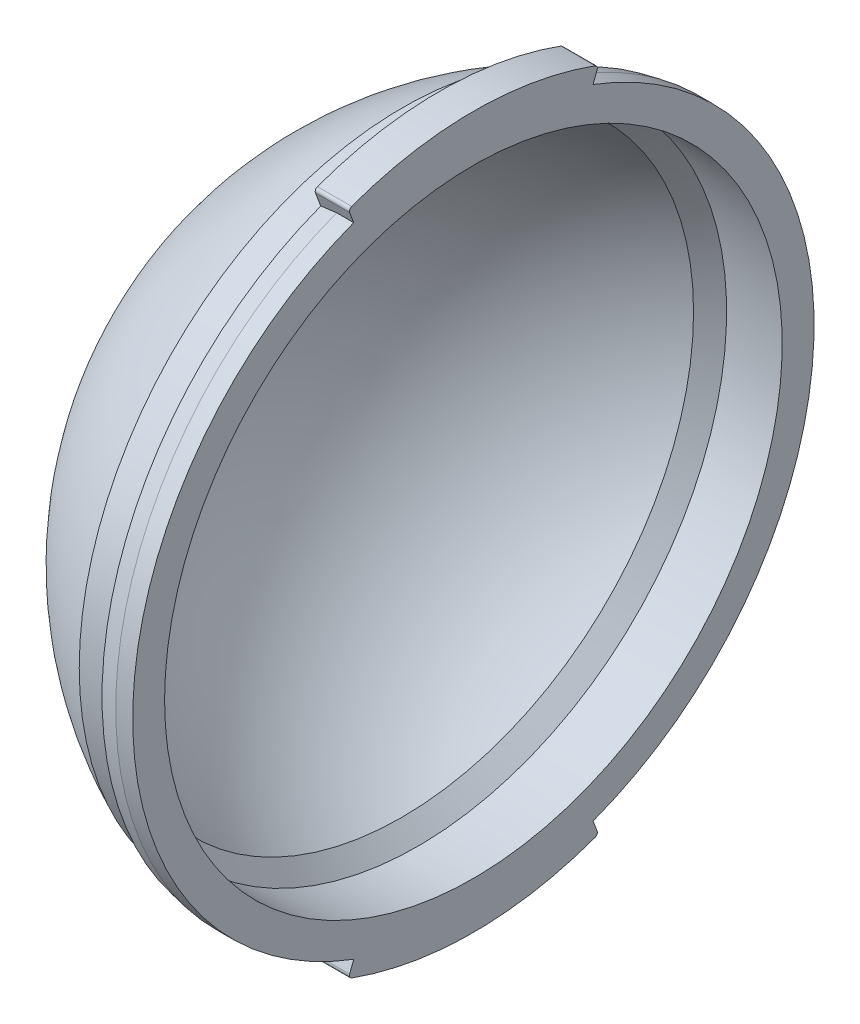
ISO-10303-21;
HEADER;
FILE_DESCRIPTION(('STEP AP214'),'2;1');
FILE_NAME('part.step','',(''),(''),'','','');
FILE_SCHEMA(('AUTOMOTIVE_DESIGN { 1 0 10303 214 1 1 1 1 }'));
ENDSEC;
DATA;
#1=APPLICATION_CONTEXT('core data for automotive mechanical design processes');
#2=APPLICATION_PROTOCOL_DEFINITION('international standard','automotive_design',2000,#1);
#3=PRODUCT_CONTEXT('',#1,'mechanical');
#4=PRODUCT('Part','Part','',(#3));
#5=PRODUCT_RELATED_PRODUCT_CATEGORY('part','',(#4));
#6=PRODUCT_DEFINITION_FORMATION('','',#4);
#7=PRODUCT_DEFINITION_CONTEXT('part definition',#1,'design');
#8=PRODUCT_DEFINITION('design','',#6,#7);
#9=PRODUCT_DEFINITION_SHAPE('','',#8);
#10=(LENGTH_UNIT() NAMED_UNIT(*) SI_UNIT(.MILLI.,.METRE.));
#11=(NAMED_UNIT(*) PLANE_ANGLE_UNIT() SI_UNIT($,.RADIAN.));
#12=(NAMED_UNIT(*) SI_UNIT($,.STERADIAN.) SOLID_ANGLE_UNIT());
#13=UNCERTAINTY_MEASURE_WITH_UNIT(LENGTH_MEASURE(1.E-05),#10,'distance_accuracy_value','');
#14=(GEOMETRIC_REPRESENTATION_CONTEXT(3) GLOBAL_UNCERTAINTY_ASSIGNED_CONTEXT((#13)) GLOBAL_UNIT_ASSIGNED_CONTEXT((#10,
#11,#12)) REPRESENTATION_CONTEXT('',''));
#15=CARTESIAN_POINT('',(0.,0.,0.));
#16=DIRECTION('',(0.,0.,1.));
#17=DIRECTION('',(1.,0.,0.));
#18=AXIS2_PLACEMENT_3D('',#15,#16,#17);
#19=CARTESIAN_POINT('',(2.22451448275866,0.,0.));
#20=DIRECTION('',(-1.,0.,0.));
#21=DIRECTION('',(0.,0.,1.));
#22=AXIS2_PLACEMENT_3D('',#19,#20,#21);
#23=CYLINDRICAL_SURFACE('',#22,50.8);
#24=DIRECTION('',(-1.,0.,0.));
#25=VECTOR('',#24,1.);
#26=CARTESIAN_POINT('',(2.22451448275866,-47.5613246859691,-17.8482602545969));
#27=LINE('',#26,#25);
#28=CARTESIAN_POINT('',(-2.5400000000001,-47.5613246859691,-17.8482602545969));
#29=VERTEX_POINT('',#28);
#30=CARTESIAN_POINT('',(0.,-47.5613246859691,-17.8482602545969));
#31=VERTEX_POINT('',#30);
#32=EDGE_CURVE('E213',#29,#31,#27,.F.);
#33=ORIENTED_EDGE('',*,*,#32,.F.);
#34=CARTESIAN_POINT('',(-2.54,0.,0.));
#35=DIRECTION('',(-1.,0.,0.));
#36=DIRECTION('',(0.,0.,1.));
#37=AXIS2_PLACEMENT_3D('',#34,#35,#36);
#38=CIRCLE('',#37,50.8);
#39=CARTESIAN_POINT('',(-2.54000000000004,47.5613246859691,-17.8482602545969));
#40=VERTEX_POINT('',#39);
#41=EDGE_CURVE('E284',#40,#29,#38,.T.);
#42=ORIENTED_EDGE('',*,*,#41,.F.);
#43=DIRECTION('',(-1.,0.,0.));
#44=VECTOR('',#43,1.);
#45=CARTESIAN_POINT('',(2.22451448275866,47.5613246859691,-17.8482602545969));
#46=LINE('',#45,#44);
#47=CARTESIAN_POINT('',(0.,47.5613246859691,-17.8482602545969));
#48=VERTEX_POINT('',#47);
#49=EDGE_CURVE('E253',#40,#48,#46,.F.);
#50=ORIENTED_EDGE('',*,*,#49,.T.);
#51=CARTESIAN_POINT('',(0.,0.,0.));
#52=DIRECTION('',(-1.,0.,0.));
#53=DIRECTION('',(0.,0.,1.));
#54=AXIS2_PLACEMENT_3D('',#51,#52,#53);
#55=CIRCLE('',#54,50.8);
#56=EDGE_CURVE('E288',#48,#31,#55,.T.);
#57=ORIENTED_EDGE('',*,*,#56,.T.);
#58=EDGE_LOOP('',(#33,#42,#50,#57));
#59=FACE_BOUND('',#58,.T.);
#60=ADVANCED_FACE('F32',(#59),#23,.T.);
#61=DIRECTION('',(-1.,0.,0.));
#62=VECTOR('',#61,1.);
#63=CARTESIAN_POINT('',(2.22451448275866,-47.5613246859691,17.8482602545969));
#64=LINE('',#63,#62);
#65=CARTESIAN_POINT('',(0.,-47.5613246859691,17.8482602545969));
#66=VERTEX_POINT('',#65);
#67=CARTESIAN_POINT('',(-2.5400000000001,-47.5613246859691,17.8482602545969));
#68=VERTEX_POINT('',#67);
#69=EDGE_CURVE('E223',#66,#68,#64,.T.);
#70=ORIENTED_EDGE('',*,*,#69,.F.);
#71=CARTESIAN_POINT('',(0.,47.5613246859691,17.8482602545969));
#72=VERTEX_POINT('',#71);
#73=EDGE_CURVE('E287',#66,#72,#55,.T.);
#74=ORIENTED_EDGE('',*,*,#73,.T.);
#75=DIRECTION('',(-1.,0.,0.));
#76=VECTOR('',#75,1.);
#77=CARTESIAN_POINT('',(2.22451448275866,47.5613246859691,17.8482602545969));
#78=LINE('',#77,#76);
#79=CARTESIAN_POINT('',(-2.54000000000004,47.5613246859691,17.8482602545969));
#80=VERTEX_POINT('',#79);
#81=EDGE_CURVE('E262',#72,#80,#78,.T.);
#82=ORIENTED_EDGE('',*,*,#81,.T.);
#83=EDGE_CURVE('E283',#68,#80,#38,.T.);
#84=ORIENTED_EDGE('',*,*,#83,.F.);
#85=EDGE_LOOP('',(#70,#74,#82,#84));
#86=FACE_BOUND('',#85,.T.);
#87=ADVANCED_FACE('F353',(#86),#23,.T.);
#88=CARTESIAN_POINT('',(-2.54,0.,0.));
#89=DIRECTION('',(1.,0.,0.));
#90=DIRECTION('',(0.,0.,-1.));
#91=AXIS2_PLACEMENT_3D('',#88,#89,#90);
#92=CONICAL_SURFACE('',#91,50.8,0.194365266095015);
#93=DIRECTION('',(0.981170462104977,-0.180830208477186,-0.0678598555465795));
#94=VECTOR('',#93,1.);
#95=CARTESIAN_POINT('',(-260.604000000003,0.,0.));
#96=LINE('',#95,#94);
#97=CARTESIAN_POINT('',(-5.08,-47.0932014115009,-17.6725884016973));
#98=VERTEX_POINT('',#97);
#99=EDGE_CURVE('E227',#98,#29,#96,.T.);
#100=ORIENTED_EDGE('',*,*,#99,.F.);
#101=CARTESIAN_POINT('',(-5.08,0.,0.));
#102=DIRECTION('',(-1.,0.,0.));
#103=DIRECTION('',(0.,0.,1.));
#104=AXIS2_PLACEMENT_3D('',#101,#102,#103);
#105=CIRCLE('',#104,50.3);
#106=CARTESIAN_POINT('',(-5.08,47.0932014115009,-17.6725884016973));
#107=VERTEX_POINT('',#106);
#108=EDGE_CURVE('E280',#107,#98,#105,.T.);
#109=ORIENTED_EDGE('',*,*,#108,.F.);
#110=DIRECTION('',(0.981170462104977,0.180830208477186,-0.0678598555465795));
#111=VECTOR('',#110,1.);
#112=CARTESIAN_POINT('',(-260.604000000003,0.,0.));
#113=LINE('',#112,#111);
#114=EDGE_CURVE('E250',#107,#40,#113,.T.);
#115=ORIENTED_EDGE('',*,*,#114,.T.);
#116=ORIENTED_EDGE('',*,*,#41,.T.);
#117=EDGE_LOOP('',(#100,#109,#115,#116));
#118=FACE_BOUND('',#117,.T.);
#119=ADVANCED_FACE('F370',(#118),#92,.T.);
#120=DIRECTION('',(-0.981170462104977,0.180830208477186,-0.0678598555465795));
#121=VECTOR('',#120,1.);
#122=CARTESIAN_POINT('',(-260.604000000003,0.,0.));
#123=LINE('',#122,#121);
#124=CARTESIAN_POINT('',(-5.08,-47.0932014115009,17.6725884016973));
#125=VERTEX_POINT('',#124);
#126=EDGE_CURVE('E221',#68,#125,#123,.T.);
#127=ORIENTED_EDGE('',*,*,#126,.F.);
#128=ORIENTED_EDGE('',*,*,#83,.T.);
#129=DIRECTION('',(-0.981170462104977,-0.180830208477186,-0.0678598555465795));
#130=VECTOR('',#129,1.);
#131=CARTESIAN_POINT('',(-260.604000000003,0.,0.));
#132=LINE('',#131,#130);
#133=CARTESIAN_POINT('',(-5.08,47.0932014115009,17.6725884016973));
#134=VERTEX_POINT('',#133);
#135=EDGE_CURVE('E259',#80,#134,#132,.T.);
#136=ORIENTED_EDGE('',*,*,#135,.T.);
#137=EDGE_CURVE('E279',#125,#134,#105,.T.);
#138=ORIENTED_EDGE('',*,*,#137,.F.);
#139=EDGE_LOOP('',(#127,#128,#136,#138));
#140=FACE_BOUND('',#139,.T.);
#141=ADVANCED_FACE('F349',(#140),#92,.T.);
#142=CARTESIAN_POINT('',(-5.08,0.,-50.3));
#143=DIRECTION('',(1.,0.,0.));
#144=DIRECTION('',(0.,0.,-1.));
#145=AXIS2_PLACEMENT_3D('',#142,#143,#144);
#146=PLANE('',#145);
#147=DIRECTION('',(0.,-0.9362465489364,-0.351343705799151));
#148=VECTOR('',#147,1.);
#149=CARTESIAN_POINT('',(-5.08,-16.5458999018626,-6.20915270011545));
#150=LINE('',#149,#148);
#151=CARTESIAN_POINT('',(-5.08,-45.1832584516707,-16.955847241867));
#152=VERTEX_POINT('',#151);
#153=EDGE_CURVE('E225',#152,#98,#150,.T.);
#154=ORIENTED_EDGE('',*,*,#153,.F.);
#155=CARTESIAN_POINT('',(-5.08,0.,0.));
#156=DIRECTION('',(-1.,0.,0.));
#157=DIRECTION('',(0.,0.,1.));
#158=AXIS2_PLACEMENT_3D('',#155,#156,#157);
#159=CIRCLE('',#158,48.26);
#160=CARTESIAN_POINT('',(-5.08,45.1832584516707,-16.955847241867));
#161=VERTEX_POINT('',#160);
#162=EDGE_CURVE('E180',#161,#152,#159,.T.);
#163=ORIENTED_EDGE('',*,*,#162,.F.);
#164=DIRECTION('',(0.,0.9362465489364,-0.351343705799151));
#165=VECTOR('',#164,1.);
#166=CARTESIAN_POINT('',(-5.08,16.5458999018626,-6.20915270011545));
#167=LINE('',#166,#165);
#168=EDGE_CURVE('E240',#161,#107,#167,.T.);
#169=ORIENTED_EDGE('',*,*,#168,.T.);
#170=ORIENTED_EDGE('',*,*,#108,.T.);
#171=EDGE_LOOP('',(#154,#163,#169,#170));
#172=FACE_BOUND('',#171,.T.);
#173=ADVANCED_FACE('F417',(#172),#146,.F.);
#174=DIRECTION('',(0.,0.9362465489364,-0.351343705799151));
#175=VECTOR('',#174,1.);
#176=CARTESIAN_POINT('',(-5.08,16.5458999018626,-6.20915270011545));
#177=LINE('',#176,#175);
#178=CARTESIAN_POINT('',(-5.08,-45.1832584516707,16.955847241867));
#179=VERTEX_POINT('',#178);
#180=EDGE_CURVE('E173',#125,#179,#177,.T.);
#181=ORIENTED_EDGE('',*,*,#180,.F.);
#182=ORIENTED_EDGE('',*,*,#137,.T.);
#183=DIRECTION('',(0.,-0.9362465489364,-0.351343705799151));
#184=VECTOR('',#183,1.);
#185=CARTESIAN_POINT('',(-5.08,-16.5458999018626,-6.20915270011545));
#186=LINE('',#185,#184);
#187=CARTESIAN_POINT('',(-5.08,45.1832584516707,16.955847241867));
#188=VERTEX_POINT('',#187);
#189=EDGE_CURVE('E256',#134,#188,#186,.T.);
#190=ORIENTED_EDGE('',*,*,#189,.T.);
#191=EDGE_CURVE('E277',#179,#188,#159,.T.);
#192=ORIENTED_EDGE('',*,*,#191,.F.);
#193=EDGE_LOOP('',(#181,#182,#190,#192));
#194=FACE_BOUND('',#193,.T.);
#195=ADVANCED_FACE('F345',(#194),#146,.F.);
#196=CARTESIAN_POINT('',(2.22451448275866,0.,0.));
#197=DIRECTION('',(-1.,0.,0.));
#198=DIRECTION('',(0.,0.,1.));
#199=AXIS2_PLACEMENT_3D('',#196,#197,#198);
#200=CYLINDRICAL_SURFACE('',#199,48.26);
#201=CARTESIAN_POINT('',(-10.5174416442761,0.,0.));
#202=DIRECTION('',(-1.,0.,0.));
#203=DIRECTION('',(0.,0.,1.));
#204=AXIS2_PLACEMENT_3D('',#201,#202,#203);
#205=CIRCLE('',#204,48.26);
#206=CARTESIAN_POINT('',(-10.5174416442761,0.,48.26));
#207=VERTEX_POINT('',#206);
#208=EDGE_CURVE('E274',#207,#207,#205,.T.);
#209=ORIENTED_EDGE('',*,*,#208,.F.);
#210=EDGE_LOOP('',(#209));
#211=FACE_BOUND('',#210,.T.);
#212=DIRECTION('',(-1.,0.,0.));
#213=VECTOR('',#212,1.);
#214=CARTESIAN_POINT('',(2.22451448275866,-45.1832584516707,-16.955847241867));
#215=LINE('',#214,#213);
#216=CARTESIAN_POINT('',(-5.1,-45.1832584516707,-16.955847241867));
#217=VERTEX_POINT('',#216);
#218=EDGE_CURVE('E171',#217,#152,#215,.F.);
#219=ORIENTED_EDGE('',*,*,#218,.F.);
#220=CARTESIAN_POINT('',(-5.1,0.,0.));
#221=DIRECTION('',(-1.,0.,0.));
#222=DIRECTION('',(0.,0.,1.));
#223=AXIS2_PLACEMENT_3D('',#220,#221,#222);
#224=CIRCLE('',#223,48.26);
#225=CARTESIAN_POINT('',(-5.1,-45.1832584516707,16.955847241867));
#226=VERTEX_POINT('',#225);
#227=EDGE_CURVE('E158',#217,#226,#224,.T.);
#228=ORIENTED_EDGE('',*,*,#227,.T.);
#229=DIRECTION('',(-1.,0.,0.));
#230=VECTOR('',#229,1.);
#231=CARTESIAN_POINT('',(2.22451448275866,-45.1832584516707,16.955847241867));
#232=LINE('',#231,#230);
#233=EDGE_CURVE('E167',#179,#226,#232,.T.);
#234=ORIENTED_EDGE('',*,*,#233,.F.);
#235=ORIENTED_EDGE('',*,*,#191,.T.);
#236=DIRECTION('',(-1.,0.,0.));
#237=VECTOR('',#236,1.);
#238=CARTESIAN_POINT('',(2.22451448275866,45.1832584516707,16.955847241867));
#239=LINE('',#238,#237);
#240=CARTESIAN_POINT('',(-5.1,45.1832584516707,16.955847241867));
#241=VERTEX_POINT('',#240);
#242=EDGE_CURVE('E295',#188,#241,#239,.T.);
#243=ORIENTED_EDGE('',*,*,#242,.T.);
#244=CARTESIAN_POINT('',(-5.1,0.,0.));
#245=DIRECTION('',(-1.,0.,0.));
#246=DIRECTION('',(0.,0.,1.));
#247=AXIS2_PLACEMENT_3D('',#244,#245,#246);
#248=CIRCLE('',#247,48.26);
#249=CARTESIAN_POINT('',(-5.1,45.1832584516707,-16.955847241867));
#250=VERTEX_POINT('',#249);
#251=EDGE_CURVE('E290',#241,#250,#248,.T.);
#252=ORIENTED_EDGE('',*,*,#251,.T.);
#253=DIRECTION('',(-1.,0.,0.));
#254=VECTOR('',#253,1.);
#255=CARTESIAN_POINT('',(2.22451448275866,45.1832584516707,-16.955847241867));
#256=LINE('',#255,#254);
#257=EDGE_CURVE('E293',#250,#161,#256,.F.);
#258=ORIENTED_EDGE('',*,*,#257,.T.);
#259=ORIENTED_EDGE('',*,*,#162,.T.);
#260=EDGE_LOOP('',(#219,#228,#234,#235,#243,#252,#258,#259));
#261=FACE_BOUND('',#260,.T.);
#262=ADVANCED_FACE('F177',(#211,#261),#200,.T.);
#263=CARTESIAN_POINT('',(0.,0.,-46.0502));
#264=DIRECTION('',(-1.,0.,0.));
#265=DIRECTION('',(0.,0.,1.));
#266=AXIS2_PLACEMENT_3D('',#263,#264,#265);
#267=PLANE('',#266);
#268=CARTESIAN_POINT('',(0.,0.,0.));
#269=DIRECTION('',(-1.,0.,0.));
#270=DIRECTION('',(0.,0.,1.));
#271=AXIS2_PLACEMENT_3D('',#268,#269,#270);
#272=CIRCLE('',#271,53.025);
#273=CARTESIAN_POINT('',(0.,-49.819568020914,-18.1565764176377));
#274=VERTEX_POINT('',#273);
#275=CARTESIAN_POINT('',(0.,-49.819568020914,18.1565764176377));
#276=VERTEX_POINT('',#275);
#277=EDGE_CURVE('E211',#274,#276,#272,.T.);
#278=ORIENTED_EDGE('',*,*,#277,.F.);
#279=CARTESIAN_POINT('',(0.,-49.349793687855,-17.9853687192159));
#280=DIRECTION('',(-1.,0.,0.));
#281=DIRECTION('',(0.,0.,1.));
#282=AXIS2_PLACEMENT_3D('',#279,#280,#281);
#283=CIRCLE('',#282,0.5);
#284=CARTESIAN_POINT('',(0.,-49.1741218349554,-18.4534919936841));
#285=VERTEX_POINT('',#284);
#286=EDGE_CURVE('E191',#274,#285,#283,.F.);
#287=ORIENTED_EDGE('',*,*,#286,.T.);
#288=DIRECTION('',(0.,-0.9362465489364,-0.351343705799151));
#289=VECTOR('',#288,1.);
#290=CARTESIAN_POINT('',(0.,-49.6444732573526,-18.63));
#291=LINE('',#290,#289);
#292=EDGE_CURVE('E209',#31,#285,#291,.T.);
#293=ORIENTED_EDGE('',*,*,#292,.F.);
#294=ORIENTED_EDGE('',*,*,#56,.F.);
#295=DIRECTION('',(0.,0.9362465489364,-0.351343705799151));
#296=VECTOR('',#295,1.);
#297=CARTESIAN_POINT('',(0.,49.6444732573526,-18.63));
#298=LINE('',#297,#296);
#299=CARTESIAN_POINT('',(0.,49.1741218349554,-18.4534919936841));
#300=VERTEX_POINT('',#299);
#301=EDGE_CURVE('E230',#48,#300,#298,.T.);
#302=ORIENTED_EDGE('',*,*,#301,.T.);
#303=CARTESIAN_POINT('',(0.,49.349793687855,-17.9853687192159));
#304=DIRECTION('',(-1.,0.,0.));
#305=DIRECTION('',(0.,0.,1.));
#306=AXIS2_PLACEMENT_3D('',#303,#304,#305);
#307=CIRCLE('',#306,0.5);
#308=CARTESIAN_POINT('',(0.,49.819568020914,-18.1565764176377));
#309=VERTEX_POINT('',#308);
#310=EDGE_CURVE('E303',#300,#309,#307,.F.);
#311=ORIENTED_EDGE('',*,*,#310,.T.);
#312=CARTESIAN_POINT('',(0.,0.,0.));
#313=DIRECTION('',(1.,0.,0.));
#314=DIRECTION('',(0.,0.,1.));
#315=AXIS2_PLACEMENT_3D('',#312,#313,#314);
#316=CIRCLE('',#315,53.025);
#317=CARTESIAN_POINT('',(0.,49.819568020914,18.1565764176377));
#318=VERTEX_POINT('',#317);
#319=EDGE_CURVE('E243',#309,#318,#316,.T.);
#320=ORIENTED_EDGE('',*,*,#319,.T.);
#321=CARTESIAN_POINT('',(0.,49.349793687855,17.9853687192159));
#322=DIRECTION('',(-1.,0.,0.));
#323=DIRECTION('',(0.,0.,1.));
#324=AXIS2_PLACEMENT_3D('',#321,#322,#323);
#325=CIRCLE('',#324,0.5);
#326=CARTESIAN_POINT('',(0.,49.1741218349554,18.4534919936841));
#327=VERTEX_POINT('',#326);
#328=EDGE_CURVE('E301',#318,#327,#325,.F.);
#329=ORIENTED_EDGE('',*,*,#328,.T.);
#330=DIRECTION('',(0.,-0.9362465489364,-0.351343705799151));
#331=VECTOR('',#330,1.);
#332=CARTESIAN_POINT('',(0.,44.9632405126706,16.8732814710042));
#333=LINE('',#332,#331);
#334=EDGE_CURVE('E235',#327,#72,#333,.T.);
#335=ORIENTED_EDGE('',*,*,#334,.T.);
#336=ORIENTED_EDGE('',*,*,#73,.F.);
#337=DIRECTION('',(0.,0.9362465489364,-0.351343705799151));
#338=VECTOR('',#337,1.);
#339=CARTESIAN_POINT('',(0.,-44.9632405126706,16.8732814710042));
#340=LINE('',#339,#338);
#341=CARTESIAN_POINT('',(0.,-49.1741218349554,18.4534919936841));
#342=VERTEX_POINT('',#341);
#343=EDGE_CURVE('E216',#342,#66,#340,.T.);
#344=ORIENTED_EDGE('',*,*,#343,.F.);
#345=CARTESIAN_POINT('',(0.,-49.349793687855,17.9853687192159));
#346=DIRECTION('',(-1.,0.,0.));
#347=DIRECTION('',(0.,0.,1.));
#348=AXIS2_PLACEMENT_3D('',#345,#346,#347);
#349=CIRCLE('',#348,0.5);
#350=EDGE_CURVE('E189',#342,#276,#349,.F.);
#351=ORIENTED_EDGE('',*,*,#350,.T.);
#352=EDGE_LOOP('',(#278,#287,#293,#294,#302,#311,#320,#329,#335,#336,#344,#351));
#353=FACE_BOUND('',#352,.T.);
#354=CARTESIAN_POINT('',(0.,0.,0.));
#355=DIRECTION('',(-1.,0.,0.));
#356=DIRECTION('',(0.,0.,1.));
#357=AXIS2_PLACEMENT_3D('',#354,#355,#356);
#358=CIRCLE('',#357,46.0502);
#359=CARTESIAN_POINT('',(0.,0.,46.0502));
#360=VERTEX_POINT('',#359);
#361=EDGE_CURVE('E265',#360,#360,#358,.T.);
#362=ORIENTED_EDGE('',*,*,#361,.T.);
#363=EDGE_LOOP('',(#362));
#364=FACE_BOUND('',#363,.T.);
#365=ADVANCED_FACE('F206',(#353,#364),#267,.F.);
#366=CARTESIAN_POINT('',(11.006167568451,0.,0.));
#367=DIRECTION('',(-1.,0.,0.));
#368=DIRECTION('',(0.,0.,-1.));
#369=AXIS2_PLACEMENT_3D('',#366,#367,#368);
#370=SPHERICAL_SURFACE('',#369,52.8421550804108);
#371=ORIENTED_EDGE('',*,*,#208,.T.);
#372=EDGE_LOOP('',(#371));
#373=FACE_BOUND('',#372,.T.);
#374=ADVANCED_FACE('F376',(#373),#370,.T.);
#375=CARTESIAN_POINT('',(11.006167568451,0.,0.));
#376=DIRECTION('',(-1.,0.,0.));
#377=DIRECTION('',(0.,0.,-1.));
#378=AXIS2_PLACEMENT_3D('',#375,#376,#377);
#379=SPHERICAL_SURFACE('',#378,48.6261861576554);
#380=CARTESIAN_POINT('',(-10.6896453974563,0.,0.));
#381=DIRECTION('',(-1.,0.,0.));
#382=DIRECTION('',(0.,0.,1.));
#383=AXIS2_PLACEMENT_3D('',#380,#381,#382);
#384=CIRCLE('',#383,43.5177857891153);
#385=CARTESIAN_POINT('',(-10.6896453974563,0.,43.5177857891153));
#386=VERTEX_POINT('',#385);
#387=EDGE_CURVE('E271',#386,#386,#384,.T.);
#388=ORIENTED_EDGE('',*,*,#387,.F.);
#389=EDGE_LOOP('',(#388));
#390=FACE_BOUND('',#389,.T.);
#391=ADVANCED_FACE('F407',(#390),#379,.F.);
#392=CARTESIAN_POINT('',(-10.6896453974563,0.,0.));
#393=DIRECTION('',(1.,0.,0.));
#394=DIRECTION('',(0.,0.,-1.));
#395=AXIS2_PLACEMENT_3D('',#392,#393,#394);
#396=CONICAL_SURFACE('',#395,43.5177857891153,0.812956598950465);
#397=CARTESIAN_POINT('',(-8.2931,0.,0.));
#398=DIRECTION('',(-1.,0.,0.));
#399=DIRECTION('',(0.,0.,1.));
#400=AXIS2_PLACEMENT_3D('',#397,#398,#399);
#401=CIRCLE('',#400,46.0502);
#402=CARTESIAN_POINT('',(-8.2931,0.,46.0502));
#403=VERTEX_POINT('',#402);
#404=EDGE_CURVE('E268',#403,#403,#401,.T.);
#405=ORIENTED_EDGE('',*,*,#404,.F.);
#406=EDGE_LOOP('',(#405));
#407=FACE_BOUND('',#406,.T.);
#408=ORIENTED_EDGE('',*,*,#387,.T.);
#409=EDGE_LOOP('',(#408));
#410=FACE_BOUND('',#409,.T.);
#411=ADVANCED_FACE('F403',(#407,#410),#396,.F.);
#412=CARTESIAN_POINT('',(2.22451448275866,0.,0.));
#413=DIRECTION('',(-1.,0.,0.));
#414=DIRECTION('',(0.,0.,1.));
#415=AXIS2_PLACEMENT_3D('',#412,#413,#414);
#416=CYLINDRICAL_SURFACE('',#415,46.0502);
#417=ORIENTED_EDGE('',*,*,#361,.F.);
#418=EDGE_LOOP('',(#417));
#419=FACE_BOUND('',#418,.T.);
#420=ORIENTED_EDGE('',*,*,#404,.T.);
#421=EDGE_LOOP('',(#420));
#422=FACE_BOUND('',#421,.T.);
#423=ADVANCED_FACE('F396',(#419,#422),#416,.F.);
#424=CARTESIAN_POINT('',(-5.1,44.9632405126706,16.8732814710042));
#425=DIRECTION('',(0.,-0.351343705799151,0.9362465489364));
#426=DIRECTION('',(0.,-0.9362465489364,-0.351343705799151));
#427=AXIS2_PLACEMENT_3D('',#424,#425,#426);
#428=PLANE('',#427);
#429=ORIENTED_EDGE('',*,*,#334,.F.);
#430=DIRECTION('',(1.,0.,0.));
#431=VECTOR('',#430,1.);
#432=CARTESIAN_POINT('',(-5.1,49.1741218349554,18.4534919936841));
#433=LINE('',#432,#431);
#434=CARTESIAN_POINT('',(-5.1,49.1741218349554,18.4534919936841));
#435=VERTEX_POINT('',#434);
#436=EDGE_CURVE('E168',#327,#435,#433,.F.);
#437=ORIENTED_EDGE('',*,*,#436,.T.);
#438=DIRECTION('',(0.,-0.9362465489364,-0.351343705799151));
#439=VECTOR('',#438,1.);
#440=CARTESIAN_POINT('',(-5.1,44.9632405126706,16.8732814710042));
#441=LINE('',#440,#439);
#442=EDGE_CURVE('E238',#435,#241,#441,.T.);
#443=ORIENTED_EDGE('',*,*,#442,.T.);
#444=ORIENTED_EDGE('',*,*,#242,.F.);
#445=ORIENTED_EDGE('',*,*,#189,.F.);
#446=ORIENTED_EDGE('',*,*,#135,.F.);
#447=ORIENTED_EDGE('',*,*,#81,.F.);
#448=EDGE_LOOP('',(#429,#437,#443,#444,#445,#446,#447));
#449=FACE_BOUND('',#448,.T.);
#450=ADVANCED_FACE('F318',(#449),#428,.T.);
#451=CARTESIAN_POINT('',(-5.1,49.6444732573526,-18.63));
#452=DIRECTION('',(0.,-0.351343705799151,-0.9362465489364));
#453=DIRECTION('',(0.,0.9362465489364,-0.351343705799151));
#454=AXIS2_PLACEMENT_3D('',#451,#452,#453);
#455=PLANE('',#454);
#456=DIRECTION('',(0.,0.9362465489364,-0.351343705799151));
#457=VECTOR('',#456,1.);
#458=CARTESIAN_POINT('',(-5.1,49.6444732573526,-18.63));
#459=LINE('',#458,#457);
#460=CARTESIAN_POINT('',(-5.1,49.1741218349554,-18.4534919936841));
#461=VERTEX_POINT('',#460);
#462=EDGE_CURVE('E231',#250,#461,#459,.T.);
#463=ORIENTED_EDGE('',*,*,#462,.T.);
#464=DIRECTION('',(1.,0.,0.));
#465=VECTOR('',#464,1.);
#466=CARTESIAN_POINT('',(-5.1,49.1741218349554,-18.4534919936841));
#467=LINE('',#466,#465);
#468=EDGE_CURVE('E298',#461,#300,#467,.T.);
#469=ORIENTED_EDGE('',*,*,#468,.T.);
#470=ORIENTED_EDGE('',*,*,#301,.F.);
#471=ORIENTED_EDGE('',*,*,#49,.F.);
#472=ORIENTED_EDGE('',*,*,#114,.F.);
#473=ORIENTED_EDGE('',*,*,#168,.F.);
#474=ORIENTED_EDGE('',*,*,#257,.F.);
#475=EDGE_LOOP('',(#463,#469,#470,#471,#472,#473,#474));
#476=FACE_BOUND('',#475,.T.);
#477=ADVANCED_FACE('F338',(#476),#455,.T.);
#478=CARTESIAN_POINT('',(-5.1,0.,0.));
#479=DIRECTION('',(-1.,0.,0.));
#480=DIRECTION('',(0.,0.,1.));
#481=AXIS2_PLACEMENT_3D('',#478,#479,#480);
#482=PLANE('',#481);
#483=CARTESIAN_POINT('',(-5.1,0.,0.));
#484=DIRECTION('',(1.,0.,0.));
#485=DIRECTION('',(0.,0.,1.));
#486=AXIS2_PLACEMENT_3D('',#483,#484,#485);
#487=CIRCLE('',#486,53.025);
#488=CARTESIAN_POINT('',(-5.1,49.819568020914,-18.1565764176377));
#489=VERTEX_POINT('',#488);
#490=CARTESIAN_POINT('',(-5.1,49.819568020914,18.1565764176377));
#491=VERTEX_POINT('',#490);
#492=EDGE_CURVE('E234',#489,#491,#487,.T.);
#493=ORIENTED_EDGE('',*,*,#492,.F.);
#494=CARTESIAN_POINT('',(-5.1,49.349793687855,-17.9853687192159));
#495=DIRECTION('',(-1.,0.,0.));
#496=DIRECTION('',(0.,0.,1.));
#497=AXIS2_PLACEMENT_3D('',#494,#495,#496);
#498=CIRCLE('',#497,0.5);
#499=EDGE_CURVE('E312',#489,#461,#498,.T.);
#500=ORIENTED_EDGE('',*,*,#499,.T.);
#501=ORIENTED_EDGE('',*,*,#462,.F.);
#502=ORIENTED_EDGE('',*,*,#251,.F.);
#503=ORIENTED_EDGE('',*,*,#442,.F.);
#504=CARTESIAN_POINT('',(-5.1,49.349793687855,17.9853687192159));
#505=DIRECTION('',(-1.,0.,0.));
#506=DIRECTION('',(0.,0.,1.));
#507=AXIS2_PLACEMENT_3D('',#504,#505,#506);
#508=CIRCLE('',#507,0.5);
#509=EDGE_CURVE('E310',#435,#491,#508,.T.);
#510=ORIENTED_EDGE('',*,*,#509,.T.);
#511=EDGE_LOOP('',(#493,#500,#501,#502,#503,#510));
#512=FACE_BOUND('',#511,.T.);
#513=ADVANCED_FACE('F326',(#512),#482,.T.);
#514=CARTESIAN_POINT('',(-5.1,0.,0.));
#515=DIRECTION('',(1.,0.,0.));
#516=DIRECTION('',(0.,0.,-1.));
#517=AXIS2_PLACEMENT_3D('',#514,#515,#516);
#518=CYLINDRICAL_SURFACE('',#517,53.025);
#519=ORIENTED_EDGE('',*,*,#319,.F.);
#520=DIRECTION('',(1.,0.,0.));
#521=VECTOR('',#520,1.);
#522=CARTESIAN_POINT('',(-5.1,49.819568020914,-18.1565764176377));
#523=LINE('',#522,#521);
#524=EDGE_CURVE('E308',#309,#489,#523,.F.);
#525=ORIENTED_EDGE('',*,*,#524,.T.);
#526=ORIENTED_EDGE('',*,*,#492,.T.);
#527=DIRECTION('',(1.,0.,0.));
#528=VECTOR('',#527,1.);
#529=CARTESIAN_POINT('',(-5.1,49.819568020914,18.1565764176377));
#530=LINE('',#529,#528);
#531=EDGE_CURVE('E305',#491,#318,#530,.T.);
#532=ORIENTED_EDGE('',*,*,#531,.T.);
#533=EDGE_LOOP('',(#519,#525,#526,#532));
#534=FACE_BOUND('',#533,.T.);
#535=ADVANCED_FACE('F331',(#534),#518,.T.);
#536=CARTESIAN_POINT('',(-5.1,49.349793687855,-17.9853687192159));
#537=DIRECTION('',(1.,0.,0.));
#538=DIRECTION('',(0.,0.,-1.));
#539=AXIS2_PLACEMENT_3D('',#536,#537,#538);
#540=CYLINDRICAL_SURFACE('',#539,0.5);
#541=ORIENTED_EDGE('',*,*,#499,.F.);
#542=ORIENTED_EDGE('',*,*,#524,.F.);
#543=ORIENTED_EDGE('',*,*,#310,.F.);
#544=ORIENTED_EDGE('',*,*,#468,.F.);
#545=EDGE_LOOP('',(#541,#542,#543,#544));
#546=FACE_BOUND('',#545,.T.);
#547=ADVANCED_FACE('F336',(#546),#540,.T.);
#548=CARTESIAN_POINT('',(-5.1,49.349793687855,17.9853687192159));
#549=DIRECTION('',(1.,0.,0.));
#550=DIRECTION('',(0.,0.,-1.));
#551=AXIS2_PLACEMENT_3D('',#548,#549,#550);
#552=CYLINDRICAL_SURFACE('',#551,0.5);
#553=ORIENTED_EDGE('',*,*,#509,.F.);
#554=ORIENTED_EDGE('',*,*,#436,.F.);
#555=ORIENTED_EDGE('',*,*,#328,.F.);
#556=ORIENTED_EDGE('',*,*,#531,.F.);
#557=EDGE_LOOP('',(#553,#554,#555,#556));
#558=FACE_BOUND('',#557,.T.);
#559=ADVANCED_FACE('F328',(#558),#552,.T.);
#560=CARTESIAN_POINT('',(-5.1,-49.6444732573526,-18.63));
#561=DIRECTION('',(0.,-0.351343705799151,0.9362465489364));
#562=DIRECTION('',(0.,-0.9362465489364,-0.351343705799151));
#563=AXIS2_PLACEMENT_3D('',#560,#561,#562);
#564=PLANE('',#563);
#565=ORIENTED_EDGE('',*,*,#292,.T.);
#566=DIRECTION('',(1.,0.,0.));
#567=VECTOR('',#566,1.);
#568=CARTESIAN_POINT('',(-5.1,-49.1741218349554,-18.4534919936841));
#569=LINE('',#568,#567);
#570=CARTESIAN_POINT('',(-5.1,-49.1741218349554,-18.4534919936841));
#571=VERTEX_POINT('',#570);
#572=EDGE_CURVE('E55',#285,#571,#569,.F.);
#573=ORIENTED_EDGE('',*,*,#572,.T.);
#574=DIRECTION('',(0.,-0.9362465489364,-0.351343705799151));
#575=VECTOR('',#574,1.);
#576=CARTESIAN_POINT('',(-5.1,-49.6444732573526,-18.63));
#577=LINE('',#576,#575);
#578=EDGE_CURVE('E160',#217,#571,#577,.T.);
#579=ORIENTED_EDGE('',*,*,#578,.F.);
#580=ORIENTED_EDGE('',*,*,#218,.T.);
#581=ORIENTED_EDGE('',*,*,#153,.T.);
#582=ORIENTED_EDGE('',*,*,#99,.T.);
#583=ORIENTED_EDGE('',*,*,#32,.T.);
#584=EDGE_LOOP('',(#565,#573,#579,#580,#581,#582,#583));
#585=FACE_BOUND('',#584,.T.);
#586=ADVANCED_FACE('F170',(#585),#564,.F.);
#587=CARTESIAN_POINT('',(-5.1,-44.9632405126706,16.8732814710042));
#588=DIRECTION('',(0.,-0.351343705799151,-0.9362465489364));
#589=DIRECTION('',(0.,0.9362465489364,-0.351343705799151));
#590=AXIS2_PLACEMENT_3D('',#587,#588,#589);
#591=PLANE('',#590);
#592=DIRECTION('',(0.,0.9362465489364,-0.351343705799151));
#593=VECTOR('',#592,1.);
#594=CARTESIAN_POINT('',(-5.1,-44.9632405126706,16.8732814710042));
#595=LINE('',#594,#593);
#596=CARTESIAN_POINT('',(-5.1,-49.1741218349554,18.4534919936841));
#597=VERTEX_POINT('',#596);
#598=EDGE_CURVE('E162',#597,#226,#595,.T.);
#599=ORIENTED_EDGE('',*,*,#598,.F.);
#600=DIRECTION('',(1.,0.,0.));
#601=VECTOR('',#600,1.);
#602=CARTESIAN_POINT('',(-5.1,-49.1741218349554,18.4534919936841));
#603=LINE('',#602,#601);
#604=EDGE_CURVE('E11',#597,#342,#603,.T.);
#605=ORIENTED_EDGE('',*,*,#604,.T.);
#606=ORIENTED_EDGE('',*,*,#343,.T.);
#607=ORIENTED_EDGE('',*,*,#69,.T.);
#608=ORIENTED_EDGE('',*,*,#126,.T.);
#609=ORIENTED_EDGE('',*,*,#180,.T.);
#610=ORIENTED_EDGE('',*,*,#233,.T.);
#611=EDGE_LOOP('',(#599,#605,#606,#607,#608,#609,#610));
#612=FACE_BOUND('',#611,.T.);
#613=ADVANCED_FACE('F357',(#612),#591,.F.);
#614=CARTESIAN_POINT('',(-5.1,0.,0.));
#615=DIRECTION('',(-1.,0.,0.));
#616=DIRECTION('',(0.,0.,1.));
#617=AXIS2_PLACEMENT_3D('',#614,#615,#616);
#618=PLANE('',#617);
#619=ORIENTED_EDGE('',*,*,#578,.T.);
#620=CARTESIAN_POINT('',(-5.1,-49.349793687855,-17.9853687192159));
#621=DIRECTION('',(-1.,0.,0.));
#622=DIRECTION('',(0.,0.,1.));
#623=AXIS2_PLACEMENT_3D('',#620,#621,#622);
#624=CIRCLE('',#623,0.5);
#625=CARTESIAN_POINT('',(-5.1,-49.819568020914,-18.1565764176377));
#626=VERTEX_POINT('',#625);
#627=EDGE_CURVE('E40',#571,#626,#624,.T.);
#628=ORIENTED_EDGE('',*,*,#627,.T.);
#629=CARTESIAN_POINT('',(-5.1,0.,0.));
#630=DIRECTION('',(-1.,0.,0.));
#631=DIRECTION('',(0.,0.,1.));
#632=AXIS2_PLACEMENT_3D('',#629,#630,#631);
#633=CIRCLE('',#632,53.025);
#634=CARTESIAN_POINT('',(-5.1,-49.819568020914,18.1565764176377));
#635=VERTEX_POINT('',#634);
#636=EDGE_CURVE('E174',#626,#635,#633,.T.);
#637=ORIENTED_EDGE('',*,*,#636,.T.);
#638=CARTESIAN_POINT('',(-5.1,-49.349793687855,17.9853687192159));
#639=DIRECTION('',(-1.,0.,0.));
#640=DIRECTION('',(0.,0.,1.));
#641=AXIS2_PLACEMENT_3D('',#638,#639,#640);
#642=CIRCLE('',#641,0.5);
#643=EDGE_CURVE('E47',#635,#597,#642,.T.);
#644=ORIENTED_EDGE('',*,*,#643,.T.);
#645=ORIENTED_EDGE('',*,*,#598,.T.);
#646=ORIENTED_EDGE('',*,*,#227,.F.);
#647=EDGE_LOOP('',(#619,#628,#637,#644,#645,#646));
#648=FACE_BOUND('',#647,.T.);
#649=ADVANCED_FACE('F159',(#648),#618,.T.);
#650=CARTESIAN_POINT('',(-5.1,0.,0.));
#651=DIRECTION('',(1.,0.,0.));
#652=DIRECTION('',(0.,0.,-1.));
#653=AXIS2_PLACEMENT_3D('',#650,#651,#652);
#654=CYLINDRICAL_SURFACE('',#653,53.025);
#655=ORIENTED_EDGE('',*,*,#636,.F.);
#656=DIRECTION('',(1.,0.,0.));
#657=VECTOR('',#656,1.);
#658=CARTESIAN_POINT('',(-5.1,-49.819568020914,-18.1565764176377));
#659=LINE('',#658,#657);
#660=EDGE_CURVE('E183',#626,#274,#659,.T.);
#661=ORIENTED_EDGE('',*,*,#660,.T.);
#662=ORIENTED_EDGE('',*,*,#277,.T.);
#663=DIRECTION('',(1.,0.,0.));
#664=VECTOR('',#663,1.);
#665=CARTESIAN_POINT('',(-5.1,-49.819568020914,18.1565764176377));
#666=LINE('',#665,#664);
#667=EDGE_CURVE('E181',#276,#635,#666,.F.);
#668=ORIENTED_EDGE('',*,*,#667,.T.);
#669=EDGE_LOOP('',(#655,#661,#662,#668));
#670=FACE_BOUND('',#669,.T.);
#671=ADVANCED_FACE('F198',(#670),#654,.T.);
#672=CARTESIAN_POINT('',(-5.1,-49.349793687855,-17.9853687192159));
#673=DIRECTION('',(1.,0.,0.));
#674=DIRECTION('',(0.,0.,-1.));
#675=AXIS2_PLACEMENT_3D('',#672,#673,#674);
#676=CYLINDRICAL_SURFACE('',#675,0.5);
#677=ORIENTED_EDGE('',*,*,#627,.F.);
#678=ORIENTED_EDGE('',*,*,#572,.F.);
#679=ORIENTED_EDGE('',*,*,#286,.F.);
#680=ORIENTED_EDGE('',*,*,#660,.F.);
#681=EDGE_LOOP('',(#677,#678,#679,#680));
#682=FACE_BOUND('',#681,.T.);
#683=ADVANCED_FACE('F203',(#682),#676,.T.);
#684=CARTESIAN_POINT('',(-5.1,-49.349793687855,17.9853687192159));
#685=DIRECTION('',(1.,0.,0.));
#686=DIRECTION('',(0.,0.,-1.));
#687=AXIS2_PLACEMENT_3D('',#684,#685,#686);
#688=CYLINDRICAL_SURFACE('',#687,0.5);
#689=ORIENTED_EDGE('',*,*,#643,.F.);
#690=ORIENTED_EDGE('',*,*,#667,.F.);
#691=ORIENTED_EDGE('',*,*,#350,.F.);
#692=ORIENTED_EDGE('',*,*,#604,.F.);
#693=EDGE_LOOP('',(#689,#690,#691,#692));
#694=FACE_BOUND('',#693,.T.);
#695=ADVANCED_FACE('F34',(#694),#688,.T.);
#696=CLOSED_SHELL('',(#60,#87,#119,#141,#173,#195,#262,#365,#374,#391,#411,#423,#450,#477,#513,
#535,#547,#559,#586,#613,#649,#671,#683,#695));
#697=MANIFOLD_SOLID_BREP('B2',#696);
#698=ADVANCED_BREP_SHAPE_REPRESENTATION('',(#18,#697),#14);
#699=SHAPE_DEFINITION_REPRESENTATION(#9,#698);
ENDSEC;
END-ISO-10303-21;
